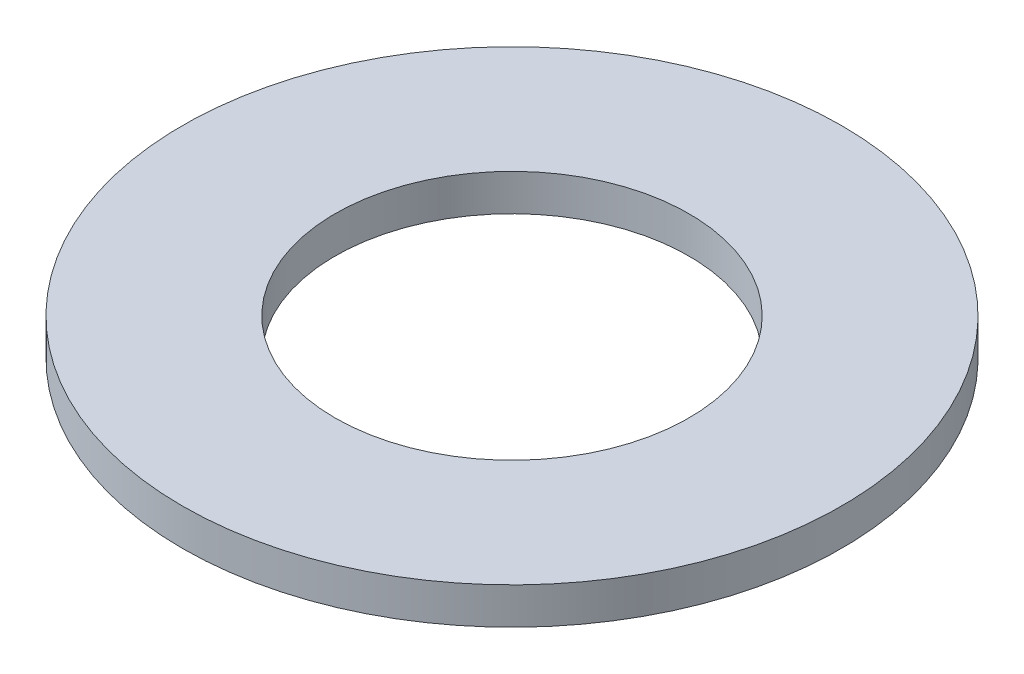
ISO-10303-21;
HEADER;
FILE_DESCRIPTION(('STEP AP214'),'2;1');
FILE_NAME('part.step','',(''),(''),'','','');
FILE_SCHEMA(('AUTOMOTIVE_DESIGN { 1 0 10303 214 1 1 1 1 }'));
ENDSEC;
DATA;
#1=APPLICATION_CONTEXT('core data for automotive mechanical design processes');
#2=APPLICATION_PROTOCOL_DEFINITION('international standard','automotive_design',2000,#1);
#3=PRODUCT_CONTEXT('',#1,'mechanical');
#4=PRODUCT('Part','Part','',(#3));
#5=PRODUCT_RELATED_PRODUCT_CATEGORY('part','',(#4));
#6=PRODUCT_DEFINITION_FORMATION('','',#4);
#7=PRODUCT_DEFINITION_CONTEXT('part definition',#1,'design');
#8=PRODUCT_DEFINITION('design','',#6,#7);
#9=PRODUCT_DEFINITION_SHAPE('','',#8);
#10=(LENGTH_UNIT() NAMED_UNIT(*) SI_UNIT(.MILLI.,.METRE.));
#11=(NAMED_UNIT(*) PLANE_ANGLE_UNIT() SI_UNIT($,.RADIAN.));
#12=(NAMED_UNIT(*) SI_UNIT($,.STERADIAN.) SOLID_ANGLE_UNIT());
#13=UNCERTAINTY_MEASURE_WITH_UNIT(LENGTH_MEASURE(1.E-05),#10,'distance_accuracy_value','');
#14=(GEOMETRIC_REPRESENTATION_CONTEXT(3) GLOBAL_UNCERTAINTY_ASSIGNED_CONTEXT((#13)) GLOBAL_UNIT_ASSIGNED_CONTEXT((#10,
#11,#12)) REPRESENTATION_CONTEXT('',''));
#15=CARTESIAN_POINT('',(0.,0.,0.));
#16=DIRECTION('',(0.,0.,1.));
#17=DIRECTION('',(1.,0.,0.));
#18=AXIS2_PLACEMENT_3D('',#15,#16,#17);
#19=CARTESIAN_POINT('',(0.,1.0541,0.));
#20=DIRECTION('',(0.,1.,0.));
#21=DIRECTION('',(0.,0.,1.));
#22=AXIS2_PLACEMENT_3D('',#19,#20,#21);
#23=PLANE('',#22);
#24=CARTESIAN_POINT('',(0.,1.0541,0.));
#25=DIRECTION('',(0.,1.,0.));
#26=DIRECTION('',(0.,0.,1.));
#27=AXIS2_PLACEMENT_3D('',#24,#25,#26);
#28=CIRCLE('',#27,9.4615);
#29=CARTESIAN_POINT('',(0.,1.0541,9.4615));
#30=VERTEX_POINT('',#29);
#31=EDGE_CURVE('E10',#30,#30,#28,.T.);
#32=ORIENTED_EDGE('',*,*,#31,.T.);
#33=EDGE_LOOP('',(#32));
#34=FACE_BOUND('',#33,.T.);
#35=CARTESIAN_POINT('',(0.,1.0541,0.));
#36=DIRECTION('',(0.,1.,0.));
#37=DIRECTION('',(0.,0.,1.));
#38=AXIS2_PLACEMENT_3D('',#35,#36,#37);
#39=CIRCLE('',#38,5.08);
#40=CARTESIAN_POINT('',(0.,1.0541,5.08));
#41=VERTEX_POINT('',#40);
#42=EDGE_CURVE('E46',#41,#41,#39,.T.);
#43=ORIENTED_EDGE('',*,*,#42,.F.);
#44=EDGE_LOOP('',(#43));
#45=FACE_BOUND('',#44,.T.);
#46=ADVANCED_FACE('F35',(#34,#45),#23,.T.);
#47=CARTESIAN_POINT('',(0.,0.,0.));
#48=DIRECTION('',(0.,1.,0.));
#49=DIRECTION('',(0.,0.,1.));
#50=AXIS2_PLACEMENT_3D('',#47,#48,#49);
#51=PLANE('',#50);
#52=CARTESIAN_POINT('',(0.,0.,0.));
#53=DIRECTION('',(0.,1.,0.));
#54=DIRECTION('',(0.,0.,1.));
#55=AXIS2_PLACEMENT_3D('',#52,#53,#54);
#56=CIRCLE('',#55,9.4615);
#57=CARTESIAN_POINT('',(0.,0.,9.4615));
#58=VERTEX_POINT('',#57);
#59=EDGE_CURVE('E39',#58,#58,#56,.T.);
#60=ORIENTED_EDGE('',*,*,#59,.F.);
#61=EDGE_LOOP('',(#60));
#62=FACE_BOUND('',#61,.T.);
#63=CARTESIAN_POINT('',(0.,0.,0.));
#64=DIRECTION('',(0.,1.,0.));
#65=DIRECTION('',(0.,0.,1.));
#66=AXIS2_PLACEMENT_3D('',#63,#64,#65);
#67=CIRCLE('',#66,5.08);
#68=CARTESIAN_POINT('',(0.,0.,5.08));
#69=VERTEX_POINT('',#68);
#70=EDGE_CURVE('E48',#69,#69,#67,.T.);
#71=ORIENTED_EDGE('',*,*,#70,.T.);
#72=EDGE_LOOP('',(#71));
#73=FACE_BOUND('',#72,.T.);
#74=ADVANCED_FACE('F58',(#62,#73),#51,.F.);
#75=CARTESIAN_POINT('',(0.,1.0541,0.));
#76=DIRECTION('',(0.,-1.,0.));
#77=DIRECTION('',(0.,0.,-1.));
#78=AXIS2_PLACEMENT_3D('',#75,#76,#77);
#79=CYLINDRICAL_SURFACE('',#78,9.4615);
#80=ORIENTED_EDGE('',*,*,#31,.F.);
#81=EDGE_LOOP('',(#80));
#82=FACE_BOUND('',#81,.T.);
#83=ORIENTED_EDGE('',*,*,#59,.T.);
#84=EDGE_LOOP('',(#83));
#85=FACE_BOUND('',#84,.T.);
#86=ADVANCED_FACE('F37',(#82,#85),#79,.T.);
#87=CARTESIAN_POINT('',(0.,1.0541,0.));
#88=DIRECTION('',(0.,-1.,0.));
#89=DIRECTION('',(0.,0.,-1.));
#90=AXIS2_PLACEMENT_3D('',#87,#88,#89);
#91=CYLINDRICAL_SURFACE('',#90,5.08);
#92=ORIENTED_EDGE('',*,*,#42,.T.);
#93=EDGE_LOOP('',(#92));
#94=FACE_BOUND('',#93,.T.);
#95=ORIENTED_EDGE('',*,*,#70,.F.);
#96=EDGE_LOOP('',(#95));
#97=FACE_BOUND('',#96,.T.);
#98=ADVANCED_FACE('F54',(#94,#97),#91,.F.);
#99=CLOSED_SHELL('',(#46,#74,#86,#98));
#100=MANIFOLD_SOLID_BREP('B2',#99);
#101=ADVANCED_BREP_SHAPE_REPRESENTATION('',(#18,#100),#14);
#102=SHAPE_DEFINITION_REPRESENTATION(#9,#101);
ENDSEC;
END-ISO-10303-21;
